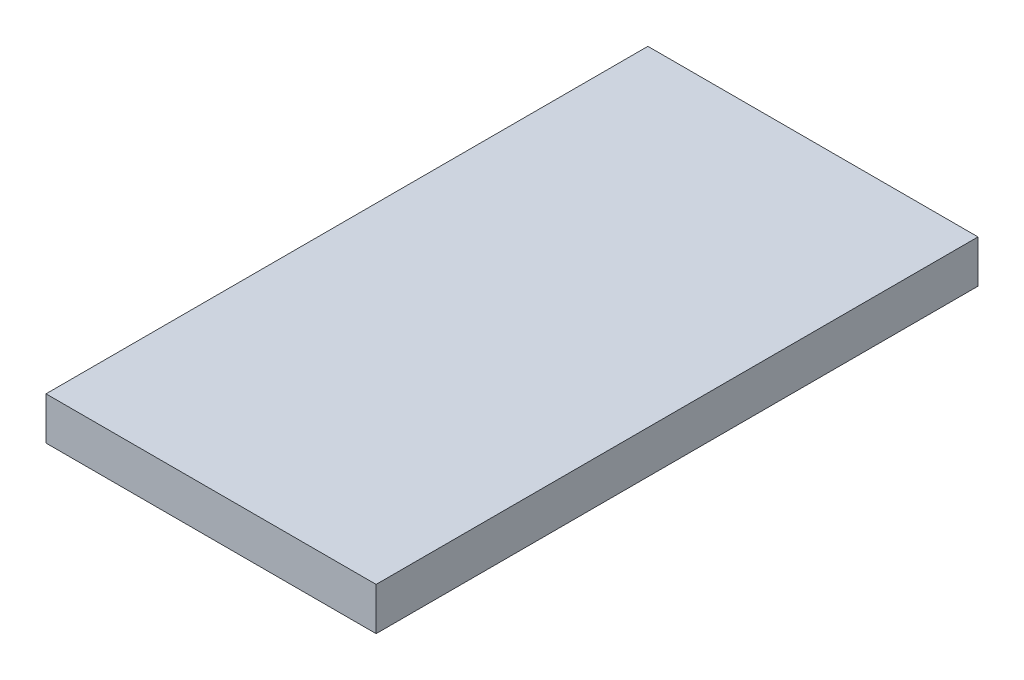
ISO-10303-21;
HEADER;
FILE_DESCRIPTION(('STEP AP214'),'2;1');
FILE_NAME('part.step','',(''),(''),'','','');
FILE_SCHEMA(('AUTOMOTIVE_DESIGN { 1 0 10303 214 1 1 1 1 }'));
ENDSEC;
DATA;
#1=APPLICATION_CONTEXT('core data for automotive mechanical design processes');
#2=APPLICATION_PROTOCOL_DEFINITION('international standard','automotive_design',2000,#1);
#3=PRODUCT_CONTEXT('',#1,'mechanical');
#4=PRODUCT('Part','Part','',(#3));
#5=PRODUCT_RELATED_PRODUCT_CATEGORY('part','',(#4));
#6=PRODUCT_DEFINITION_FORMATION('','',#4);
#7=PRODUCT_DEFINITION_CONTEXT('part definition',#1,'design');
#8=PRODUCT_DEFINITION('design','',#6,#7);
#9=PRODUCT_DEFINITION_SHAPE('','',#8);
#10=(LENGTH_UNIT() NAMED_UNIT(*) SI_UNIT(.MILLI.,.METRE.));
#11=(NAMED_UNIT(*) PLANE_ANGLE_UNIT() SI_UNIT($,.RADIAN.));
#12=(NAMED_UNIT(*) SI_UNIT($,.STERADIAN.) SOLID_ANGLE_UNIT());
#13=UNCERTAINTY_MEASURE_WITH_UNIT(LENGTH_MEASURE(1.E-05),#10,'distance_accuracy_value','');
#14=(GEOMETRIC_REPRESENTATION_CONTEXT(3) GLOBAL_UNCERTAINTY_ASSIGNED_CONTEXT((#13)) GLOBAL_UNIT_ASSIGNED_CONTEXT((#10,
#11,#12)) REPRESENTATION_CONTEXT('',''));
#15=CARTESIAN_POINT('',(0.,0.,0.));
#16=DIRECTION('',(0.,0.,1.));
#17=DIRECTION('',(1.,0.,0.));
#18=AXIS2_PLACEMENT_3D('',#15,#16,#17);
#19=CARTESIAN_POINT('',(0.,3.,0.));
#20=DIRECTION('',(1.,0.,0.));
#21=DIRECTION('',(0.,0.,-1.));
#22=AXIS2_PLACEMENT_3D('',#19,#20,#21);
#23=PLANE('',#22);
#24=DIRECTION('',(0.,0.,1.));
#25=VECTOR('',#24,1.);
#26=CARTESIAN_POINT('',(0.,0.,0.));
#27=LINE('',#26,#25);
#28=CARTESIAN_POINT('',(0.,0.,0.));
#29=VERTEX_POINT('',#28);
#30=CARTESIAN_POINT('',(0.,0.,42.3));
#31=VERTEX_POINT('',#30);
#32=EDGE_CURVE('E96',#29,#31,#27,.T.);
#33=ORIENTED_EDGE('',*,*,#32,.T.);
#34=DIRECTION('',(0.,-1.,0.));
#35=VECTOR('',#34,1.);
#36=CARTESIAN_POINT('',(0.,3.,42.3));
#37=LINE('',#36,#35);
#38=CARTESIAN_POINT('',(0.,3.,42.3));
#39=VERTEX_POINT('',#38);
#40=EDGE_CURVE('E11',#39,#31,#37,.T.);
#41=ORIENTED_EDGE('',*,*,#40,.F.);
#42=DIRECTION('',(0.,0.,1.));
#43=VECTOR('',#42,1.);
#44=CARTESIAN_POINT('',(0.,3.,0.));
#45=LINE('',#44,#43);
#46=CARTESIAN_POINT('',(0.,3.,0.));
#47=VERTEX_POINT('',#46);
#48=EDGE_CURVE('E84',#47,#39,#45,.T.);
#49=ORIENTED_EDGE('',*,*,#48,.F.);
#50=DIRECTION('',(0.,-1.,0.));
#51=VECTOR('',#50,1.);
#52=CARTESIAN_POINT('',(0.,3.,0.));
#53=LINE('',#52,#51);
#54=EDGE_CURVE('E92',#47,#29,#53,.T.);
#55=ORIENTED_EDGE('',*,*,#54,.T.);
#56=EDGE_LOOP('',(#33,#41,#49,#55));
#57=FACE_BOUND('',#56,.T.);
#58=ADVANCED_FACE('F33',(#57),#23,.F.);
#59=CARTESIAN_POINT('',(0.,3.,42.3));
#60=DIRECTION('',(0.,0.,-1.));
#61=DIRECTION('',(-1.,0.,0.));
#62=AXIS2_PLACEMENT_3D('',#59,#60,#61);
#63=PLANE('',#62);
#64=DIRECTION('',(1.,0.,0.));
#65=VECTOR('',#64,1.);
#66=CARTESIAN_POINT('',(0.,0.,42.3));
#67=LINE('',#66,#65);
#68=CARTESIAN_POINT('',(23.2,0.,42.3));
#69=VERTEX_POINT('',#68);
#70=EDGE_CURVE('E88',#31,#69,#67,.T.);
#71=ORIENTED_EDGE('',*,*,#70,.T.);
#72=DIRECTION('',(0.,-1.,0.));
#73=VECTOR('',#72,1.);
#74=CARTESIAN_POINT('',(23.2,3.,42.3));
#75=LINE('',#74,#73);
#76=CARTESIAN_POINT('',(23.2,3.,42.3));
#77=VERTEX_POINT('',#76);
#78=EDGE_CURVE('E41',#77,#69,#75,.T.);
#79=ORIENTED_EDGE('',*,*,#78,.F.);
#80=DIRECTION('',(1.,0.,0.));
#81=VECTOR('',#80,1.);
#82=CARTESIAN_POINT('',(0.,3.,42.3));
#83=LINE('',#82,#81);
#84=EDGE_CURVE('E79',#39,#77,#83,.T.);
#85=ORIENTED_EDGE('',*,*,#84,.F.);
#86=ORIENTED_EDGE('',*,*,#40,.T.);
#87=EDGE_LOOP('',(#71,#79,#85,#86));
#88=FACE_BOUND('',#87,.T.);
#89=ADVANCED_FACE('F87',(#88),#63,.F.);
#90=CARTESIAN_POINT('',(23.2,3.,0.));
#91=DIRECTION('',(-1.,0.,0.));
#92=DIRECTION('',(0.,0.,1.));
#93=AXIS2_PLACEMENT_3D('',#90,#91,#92);
#94=PLANE('',#93);
#95=DIRECTION('',(0.,0.,-1.));
#96=VECTOR('',#95,1.);
#97=CARTESIAN_POINT('',(23.2,0.,0.));
#98=LINE('',#97,#96);
#99=CARTESIAN_POINT('',(23.2,0.,0.));
#100=VERTEX_POINT('',#99);
#101=EDGE_CURVE('E66',#69,#100,#98,.T.);
#102=ORIENTED_EDGE('',*,*,#101,.T.);
#103=DIRECTION('',(0.,-1.,0.));
#104=VECTOR('',#103,1.);
#105=CARTESIAN_POINT('',(23.2,3.,0.));
#106=LINE('',#105,#104);
#107=CARTESIAN_POINT('',(23.2,3.,0.));
#108=VERTEX_POINT('',#107);
#109=EDGE_CURVE('E89',#108,#100,#106,.T.);
#110=ORIENTED_EDGE('',*,*,#109,.F.);
#111=DIRECTION('',(0.,0.,-1.));
#112=VECTOR('',#111,1.);
#113=CARTESIAN_POINT('',(23.2,3.,0.));
#114=LINE('',#113,#112);
#115=EDGE_CURVE('E82',#77,#108,#114,.T.);
#116=ORIENTED_EDGE('',*,*,#115,.F.);
#117=ORIENTED_EDGE('',*,*,#78,.T.);
#118=EDGE_LOOP('',(#102,#110,#116,#117));
#119=FACE_BOUND('',#118,.T.);
#120=ADVANCED_FACE('F90',(#119),#94,.F.);
#121=CARTESIAN_POINT('',(0.,3.,0.));
#122=DIRECTION('',(0.,0.,1.));
#123=DIRECTION('',(1.,0.,0.));
#124=AXIS2_PLACEMENT_3D('',#121,#122,#123);
#125=PLANE('',#124);
#126=DIRECTION('',(-1.,0.,0.));
#127=VECTOR('',#126,1.);
#128=CARTESIAN_POINT('',(0.,0.,0.));
#129=LINE('',#128,#127);
#130=EDGE_CURVE('E72',#100,#29,#129,.T.);
#131=ORIENTED_EDGE('',*,*,#130,.T.);
#132=ORIENTED_EDGE('',*,*,#54,.F.);
#133=DIRECTION('',(-1.,0.,0.));
#134=VECTOR('',#133,1.);
#135=CARTESIAN_POINT('',(0.,3.,0.));
#136=LINE('',#135,#134);
#137=EDGE_CURVE('E49',#108,#47,#136,.T.);
#138=ORIENTED_EDGE('',*,*,#137,.F.);
#139=ORIENTED_EDGE('',*,*,#109,.T.);
#140=EDGE_LOOP('',(#131,#132,#138,#139));
#141=FACE_BOUND('',#140,.T.);
#142=ADVANCED_FACE('F103',(#141),#125,.F.);
#143=CARTESIAN_POINT('',(0.,3.,0.));
#144=DIRECTION('',(0.,1.,0.));
#145=DIRECTION('',(0.,0.,1.));
#146=AXIS2_PLACEMENT_3D('',#143,#144,#145);
#147=PLANE('',#146);
#148=ORIENTED_EDGE('',*,*,#48,.T.);
#149=ORIENTED_EDGE('',*,*,#84,.T.);
#150=ORIENTED_EDGE('',*,*,#115,.T.);
#151=ORIENTED_EDGE('',*,*,#137,.T.);
#152=EDGE_LOOP('',(#148,#149,#150,#151));
#153=FACE_BOUND('',#152,.T.);
#154=ADVANCED_FACE('F80',(#153),#147,.T.);
#155=CARTESIAN_POINT('',(0.,0.,0.));
#156=DIRECTION('',(0.,1.,0.));
#157=DIRECTION('',(0.,0.,1.));
#158=AXIS2_PLACEMENT_3D('',#155,#156,#157);
#159=PLANE('',#158);
#160=ORIENTED_EDGE('',*,*,#32,.F.);
#161=ORIENTED_EDGE('',*,*,#130,.F.);
#162=ORIENTED_EDGE('',*,*,#101,.F.);
#163=ORIENTED_EDGE('',*,*,#70,.F.);
#164=EDGE_LOOP('',(#160,#161,#162,#163));
#165=FACE_BOUND('',#164,.T.);
#166=ADVANCED_FACE('F106',(#165),#159,.F.);
#167=CLOSED_SHELL('',(#58,#89,#120,#142,#154,#166));
#168=MANIFOLD_SOLID_BREP('B2',#167);
#169=ADVANCED_BREP_SHAPE_REPRESENTATION('',(#18,#168),#14);
#170=SHAPE_DEFINITION_REPRESENTATION(#9,#169);
ENDSEC;
END-ISO-10303-21;
